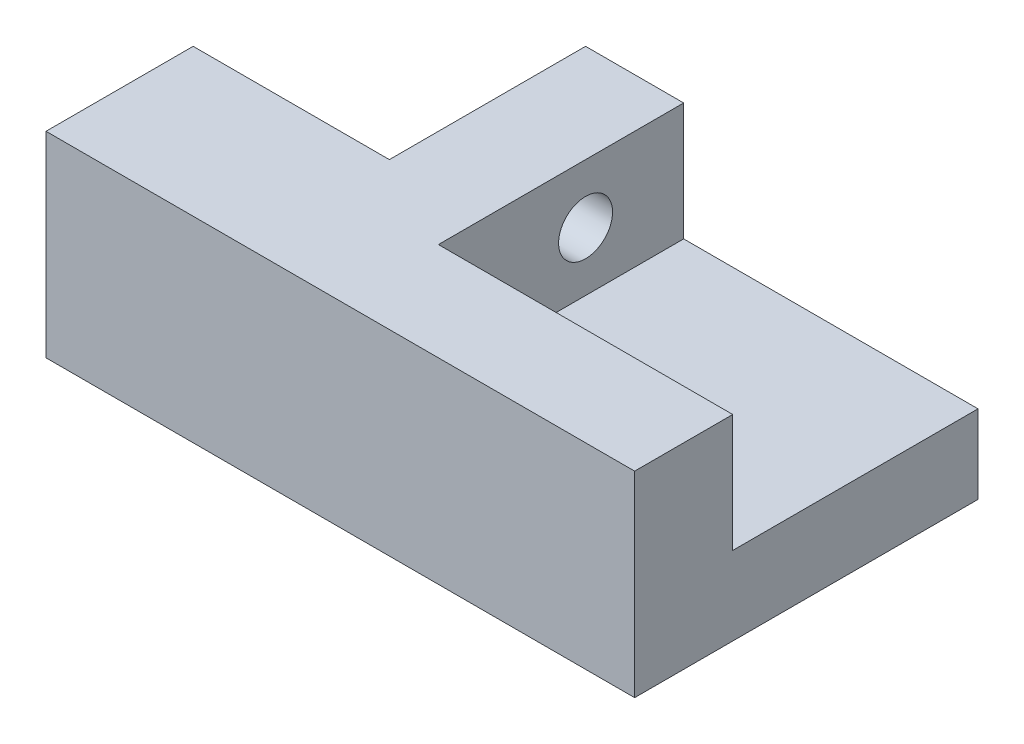
ISO-10303-21;
HEADER;
FILE_DESCRIPTION(('STEP AP214'),'2;1');
FILE_NAME('part.step','',(''),(''),'','','');
FILE_SCHEMA(('AUTOMOTIVE_DESIGN { 1 0 10303 214 1 1 1 1 }'));
ENDSEC;
DATA;
#1=APPLICATION_CONTEXT('core data for automotive mechanical design processes');
#2=APPLICATION_PROTOCOL_DEFINITION('international standard','automotive_design',2000,#1);
#3=PRODUCT_CONTEXT('',#1,'mechanical');
#4=PRODUCT('Part','Part','',(#3));
#5=PRODUCT_RELATED_PRODUCT_CATEGORY('part','',(#4));
#6=PRODUCT_DEFINITION_FORMATION('','',#4);
#7=PRODUCT_DEFINITION_CONTEXT('part definition',#1,'design');
#8=PRODUCT_DEFINITION('design','',#6,#7);
#9=PRODUCT_DEFINITION_SHAPE('','',#8);
#10=(LENGTH_UNIT() NAMED_UNIT(*) SI_UNIT(.MILLI.,.METRE.));
#11=(NAMED_UNIT(*) PLANE_ANGLE_UNIT() SI_UNIT($,.RADIAN.));
#12=(NAMED_UNIT(*) SI_UNIT($,.STERADIAN.) SOLID_ANGLE_UNIT());
#13=UNCERTAINTY_MEASURE_WITH_UNIT(LENGTH_MEASURE(1.E-05),#10,'distance_accuracy_value','');
#14=(GEOMETRIC_REPRESENTATION_CONTEXT(3) GLOBAL_UNCERTAINTY_ASSIGNED_CONTEXT((#13)) GLOBAL_UNIT_ASSIGNED_CONTEXT((#10,
#11,#12)) REPRESENTATION_CONTEXT('',''));
#15=CARTESIAN_POINT('',(0.,0.,0.));
#16=DIRECTION('',(0.,0.,1.));
#17=DIRECTION('',(1.,0.,0.));
#18=AXIS2_PLACEMENT_3D('',#15,#16,#17);
#19=CARTESIAN_POINT('',(0.,20.,0.));
#20=DIRECTION('',(1.,0.,0.));
#21=DIRECTION('',(0.,0.,-1.));
#22=AXIS2_PLACEMENT_3D('',#19,#20,#21);
#23=PLANE('',#22);
#24=DIRECTION('',(0.,0.,1.));
#25=VECTOR('',#24,1.);
#26=CARTESIAN_POINT('',(0.,0.,0.));
#27=LINE('',#26,#25);
#28=CARTESIAN_POINT('',(0.,0.,-15.));
#29=VERTEX_POINT('',#28);
#30=CARTESIAN_POINT('',(0.,0.,0.));
#31=VERTEX_POINT('',#30);
#32=EDGE_CURVE('E126',#29,#31,#27,.T.);
#33=ORIENTED_EDGE('',*,*,#32,.T.);
#34=DIRECTION('',(0.,-1.,0.));
#35=VECTOR('',#34,1.);
#36=CARTESIAN_POINT('',(0.,20.,0.));
#37=LINE('',#36,#35);
#38=CARTESIAN_POINT('',(0.,20.,0.));
#39=VERTEX_POINT('',#38);
#40=EDGE_CURVE('E11',#39,#31,#37,.T.);
#41=ORIENTED_EDGE('',*,*,#40,.F.);
#42=DIRECTION('',(0.,0.,1.));
#43=VECTOR('',#42,1.);
#44=CARTESIAN_POINT('',(0.,20.,0.));
#45=LINE('',#44,#43);
#46=CARTESIAN_POINT('',(0.,20.,-15.));
#47=VERTEX_POINT('',#46);
#48=EDGE_CURVE('E139',#47,#39,#45,.T.);
#49=ORIENTED_EDGE('',*,*,#48,.F.);
#50=DIRECTION('',(0.,-1.,0.));
#51=VECTOR('',#50,1.);
#52=CARTESIAN_POINT('',(0.,20.,-15.));
#53=LINE('',#52,#51);
#54=EDGE_CURVE('E122',#47,#29,#53,.T.);
#55=ORIENTED_EDGE('',*,*,#54,.T.);
#56=EDGE_LOOP('',(#33,#41,#49,#55));
#57=FACE_BOUND('',#56,.T.);
#58=ADVANCED_FACE('F33',(#57),#23,.F.);
#59=CARTESIAN_POINT('',(0.,20.,0.));
#60=DIRECTION('',(0.,0.,-1.));
#61=DIRECTION('',(-1.,0.,0.));
#62=AXIS2_PLACEMENT_3D('',#59,#60,#61);
#63=PLANE('',#62);
#64=DIRECTION('',(1.,0.,0.));
#65=VECTOR('',#64,1.);
#66=CARTESIAN_POINT('',(0.,0.,0.));
#67=LINE('',#66,#65);
#68=CARTESIAN_POINT('',(60.,0.,0.));
#69=VERTEX_POINT('',#68);
#70=EDGE_CURVE('E129',#31,#69,#67,.T.);
#71=ORIENTED_EDGE('',*,*,#70,.T.);
#72=DIRECTION('',(0.,-1.,0.));
#73=VECTOR('',#72,1.);
#74=CARTESIAN_POINT('',(60.,20.,0.));
#75=LINE('',#74,#73);
#76=CARTESIAN_POINT('',(60.,20.,0.));
#77=VERTEX_POINT('',#76);
#78=EDGE_CURVE('E40',#77,#69,#75,.T.);
#79=ORIENTED_EDGE('',*,*,#78,.F.);
#80=DIRECTION('',(1.,0.,0.));
#81=VECTOR('',#80,1.);
#82=CARTESIAN_POINT('',(0.,20.,0.));
#83=LINE('',#82,#81);
#84=EDGE_CURVE('E91',#39,#77,#83,.T.);
#85=ORIENTED_EDGE('',*,*,#84,.F.);
#86=ORIENTED_EDGE('',*,*,#40,.T.);
#87=EDGE_LOOP('',(#71,#79,#85,#86));
#88=FACE_BOUND('',#87,.T.);
#89=ADVANCED_FACE('F209',(#88),#63,.F.);
#90=CARTESIAN_POINT('',(60.,20.,0.));
#91=DIRECTION('',(-1.,0.,0.));
#92=DIRECTION('',(0.,0.,1.));
#93=AXIS2_PLACEMENT_3D('',#90,#91,#92);
#94=PLANE('',#93);
#95=DIRECTION('',(0.,0.,-1.));
#96=VECTOR('',#95,1.);
#97=CARTESIAN_POINT('',(60.,8.,-35.));
#98=LINE('',#97,#96);
#99=CARTESIAN_POINT('',(60.,8.,-10.));
#100=VERTEX_POINT('',#99);
#101=CARTESIAN_POINT('',(60.,8.,-35.));
#102=VERTEX_POINT('',#101);
#103=EDGE_CURVE('E189',#100,#102,#98,.T.);
#104=ORIENTED_EDGE('',*,*,#103,.F.);
#105=DIRECTION('',(0.,1.,0.));
#106=VECTOR('',#105,1.);
#107=CARTESIAN_POINT('',(60.,8.,-10.));
#108=LINE('',#107,#106);
#109=CARTESIAN_POINT('',(60.,20.,-10.));
#110=VERTEX_POINT('',#109);
#111=EDGE_CURVE('E130',#100,#110,#108,.T.);
#112=ORIENTED_EDGE('',*,*,#111,.T.);
#113=DIRECTION('',(0.,0.,-1.));
#114=VECTOR('',#113,1.);
#115=CARTESIAN_POINT('',(60.,20.,0.));
#116=LINE('',#115,#114);
#117=EDGE_CURVE('E108',#77,#110,#116,.T.);
#118=ORIENTED_EDGE('',*,*,#117,.F.);
#119=ORIENTED_EDGE('',*,*,#78,.T.);
#120=DIRECTION('',(0.,0.,-1.));
#121=VECTOR('',#120,1.);
#122=CARTESIAN_POINT('',(60.,0.,0.));
#123=LINE('',#122,#121);
#124=CARTESIAN_POINT('',(60.,0.,-35.));
#125=VERTEX_POINT('',#124);
#126=EDGE_CURVE('E132',#69,#125,#123,.T.);
#127=ORIENTED_EDGE('',*,*,#126,.T.);
#128=DIRECTION('',(0.,-1.,0.));
#129=VECTOR('',#128,1.);
#130=CARTESIAN_POINT('',(60.,20.,-35.));
#131=LINE('',#130,#129);
#132=EDGE_CURVE('E117',#102,#125,#131,.T.);
#133=ORIENTED_EDGE('',*,*,#132,.F.);
#134=EDGE_LOOP('',(#104,#112,#118,#119,#127,#133));
#135=FACE_BOUND('',#134,.T.);
#136=ADVANCED_FACE('F147',(#135),#94,.F.);
#137=CARTESIAN_POINT('',(20.,20.,-35.));
#138=DIRECTION('',(0.,0.,1.));
#139=DIRECTION('',(1.,0.,0.));
#140=AXIS2_PLACEMENT_3D('',#137,#138,#139);
#141=PLANE('',#140);
#142=DIRECTION('',(-1.,0.,0.));
#143=VECTOR('',#142,1.);
#144=CARTESIAN_POINT('',(20.,20.,-35.));
#145=LINE('',#144,#143);
#146=CARTESIAN_POINT('',(30.,20.,-35.));
#147=VERTEX_POINT('',#146);
#148=CARTESIAN_POINT('',(20.,20.,-35.));
#149=VERTEX_POINT('',#148);
#150=EDGE_CURVE('E98',#147,#149,#145,.T.);
#151=ORIENTED_EDGE('',*,*,#150,.F.);
#152=DIRECTION('',(0.,1.,0.));
#153=VECTOR('',#152,1.);
#154=CARTESIAN_POINT('',(30.,8.,-35.));
#155=LINE('',#154,#153);
#156=CARTESIAN_POINT('',(30.,8.,-35.));
#157=VERTEX_POINT('',#156);
#158=EDGE_CURVE('E47',#157,#147,#155,.T.);
#159=ORIENTED_EDGE('',*,*,#158,.F.);
#160=DIRECTION('',(-1.,0.,0.));
#161=VECTOR('',#160,1.);
#162=CARTESIAN_POINT('',(60.,8.,-35.));
#163=LINE('',#162,#161);
#164=EDGE_CURVE('E185',#102,#157,#163,.T.);
#165=ORIENTED_EDGE('',*,*,#164,.F.);
#166=ORIENTED_EDGE('',*,*,#132,.T.);
#167=DIRECTION('',(-1.,0.,0.));
#168=VECTOR('',#167,1.);
#169=CARTESIAN_POINT('',(20.,0.,-35.));
#170=LINE('',#169,#168);
#171=CARTESIAN_POINT('',(20.,0.,-35.));
#172=VERTEX_POINT('',#171);
#173=EDGE_CURVE('E114',#125,#172,#170,.T.);
#174=ORIENTED_EDGE('',*,*,#173,.T.);
#175=DIRECTION('',(0.,-1.,0.));
#176=VECTOR('',#175,1.);
#177=CARTESIAN_POINT('',(20.,20.,-35.));
#178=LINE('',#177,#176);
#179=EDGE_CURVE('E111',#149,#172,#178,.T.);
#180=ORIENTED_EDGE('',*,*,#179,.F.);
#181=EDGE_LOOP('',(#151,#159,#165,#166,#174,#180));
#182=FACE_BOUND('',#181,.T.);
#183=ADVANCED_FACE('F112',(#182),#141,.F.);
#184=CARTESIAN_POINT('',(20.,20.,-35.));
#185=DIRECTION('',(1.,0.,0.));
#186=DIRECTION('',(0.,0.,-1.));
#187=AXIS2_PLACEMENT_3D('',#184,#185,#186);
#188=PLANE('',#187);
#189=CARTESIAN_POINT('',(20.,14.,-25.));
#190=DIRECTION('',(1.,0.,0.));
#191=DIRECTION('',(0.,0.,-1.));
#192=AXIS2_PLACEMENT_3D('',#189,#190,#191);
#193=CIRCLE('',#192,2.75);
#194=CARTESIAN_POINT('',(20.,14.,-27.75));
#195=VERTEX_POINT('',#194);
#196=EDGE_CURVE('E194',#195,#195,#193,.T.);
#197=ORIENTED_EDGE('',*,*,#196,.T.);
#198=EDGE_LOOP('',(#197));
#199=FACE_BOUND('',#198,.T.);
#200=DIRECTION('',(0.,0.,1.));
#201=VECTOR('',#200,1.);
#202=CARTESIAN_POINT('',(20.,0.,-35.));
#203=LINE('',#202,#201);
#204=CARTESIAN_POINT('',(20.,0.,-15.));
#205=VERTEX_POINT('',#204);
#206=EDGE_CURVE('E136',#172,#205,#203,.T.);
#207=ORIENTED_EDGE('',*,*,#206,.T.);
#208=DIRECTION('',(0.,-1.,0.));
#209=VECTOR('',#208,1.);
#210=CARTESIAN_POINT('',(20.,20.,-15.));
#211=LINE('',#210,#209);
#212=CARTESIAN_POINT('',(20.,20.,-15.));
#213=VERTEX_POINT('',#212);
#214=EDGE_CURVE('E118',#213,#205,#211,.T.);
#215=ORIENTED_EDGE('',*,*,#214,.F.);
#216=DIRECTION('',(0.,0.,1.));
#217=VECTOR('',#216,1.);
#218=CARTESIAN_POINT('',(20.,20.,-35.));
#219=LINE('',#218,#217);
#220=EDGE_CURVE('E103',#149,#213,#219,.T.);
#221=ORIENTED_EDGE('',*,*,#220,.F.);
#222=ORIENTED_EDGE('',*,*,#179,.T.);
#223=EDGE_LOOP('',(#207,#215,#221,#222));
#224=FACE_BOUND('',#223,.T.);
#225=ADVANCED_FACE('F120',(#199,#224),#188,.F.);
#226=CARTESIAN_POINT('',(0.,20.,-15.));
#227=DIRECTION('',(0.,0.,1.));
#228=DIRECTION('',(1.,0.,0.));
#229=AXIS2_PLACEMENT_3D('',#226,#227,#228);
#230=PLANE('',#229);
#231=DIRECTION('',(-1.,0.,0.));
#232=VECTOR('',#231,1.);
#233=CARTESIAN_POINT('',(0.,0.,-15.));
#234=LINE('',#233,#232);
#235=EDGE_CURVE('E83',#205,#29,#234,.T.);
#236=ORIENTED_EDGE('',*,*,#235,.T.);
#237=ORIENTED_EDGE('',*,*,#54,.F.);
#238=DIRECTION('',(-1.,0.,0.));
#239=VECTOR('',#238,1.);
#240=CARTESIAN_POINT('',(0.,20.,-15.));
#241=LINE('',#240,#239);
#242=EDGE_CURVE('E56',#213,#47,#241,.T.);
#243=ORIENTED_EDGE('',*,*,#242,.F.);
#244=ORIENTED_EDGE('',*,*,#214,.T.);
#245=EDGE_LOOP('',(#236,#237,#243,#244));
#246=FACE_BOUND('',#245,.T.);
#247=ADVANCED_FACE('F153',(#246),#230,.F.);
#248=CARTESIAN_POINT('',(0.,20.,0.));
#249=DIRECTION('',(0.,-1.,0.));
#250=DIRECTION('',(0.,0.,-1.));
#251=AXIS2_PLACEMENT_3D('',#248,#249,#250);
#252=PLANE('',#251);
#253=ORIENTED_EDGE('',*,*,#117,.T.);
#254=DIRECTION('',(1.,0.,0.));
#255=VECTOR('',#254,1.);
#256=CARTESIAN_POINT('',(60.,20.,-10.));
#257=LINE('',#256,#255);
#258=CARTESIAN_POINT('',(30.,20.,-10.));
#259=VERTEX_POINT('',#258);
#260=EDGE_CURVE('E163',#259,#110,#257,.T.);
#261=ORIENTED_EDGE('',*,*,#260,.F.);
#262=DIRECTION('',(0.,0.,1.));
#263=VECTOR('',#262,1.);
#264=CARTESIAN_POINT('',(30.,20.,-35.));
#265=LINE('',#264,#263);
#266=EDGE_CURVE('E106',#147,#259,#265,.T.);
#267=ORIENTED_EDGE('',*,*,#266,.F.);
#268=ORIENTED_EDGE('',*,*,#150,.T.);
#269=ORIENTED_EDGE('',*,*,#220,.T.);
#270=ORIENTED_EDGE('',*,*,#242,.T.);
#271=ORIENTED_EDGE('',*,*,#48,.T.);
#272=ORIENTED_EDGE('',*,*,#84,.T.);
#273=EDGE_LOOP('',(#253,#261,#267,#268,#269,#270,#271,#272));
#274=FACE_BOUND('',#273,.T.);
#275=ADVANCED_FACE('F101',(#274),#252,.F.);
#276=CARTESIAN_POINT('',(0.,0.,0.));
#277=DIRECTION('',(0.,-1.,0.));
#278=DIRECTION('',(0.,0.,-1.));
#279=AXIS2_PLACEMENT_3D('',#276,#277,#278);
#280=PLANE('',#279);
#281=CARTESIAN_POINT('',(46.1,0.,-12.5257624928588));
#282=DIRECTION('',(0.,-1.,0.));
#283=DIRECTION('',(0.,0.,-1.));
#284=AXIS2_PLACEMENT_3D('',#281,#282,#283);
#285=CIRCLE('',#284,6.7);
#286=CARTESIAN_POINT('',(46.1,0.,-19.2257624928588));
#287=VERTEX_POINT('',#286);
#288=EDGE_CURVE('E301',#287,#287,#285,.T.);
#289=ORIENTED_EDGE('',*,*,#288,.F.);
#290=EDGE_LOOP('',(#289));
#291=FACE_BOUND('',#290,.T.);
#292=ORIENTED_EDGE('',*,*,#32,.F.);
#293=ORIENTED_EDGE('',*,*,#235,.F.);
#294=ORIENTED_EDGE('',*,*,#206,.F.);
#295=ORIENTED_EDGE('',*,*,#173,.F.);
#296=ORIENTED_EDGE('',*,*,#126,.F.);
#297=ORIENTED_EDGE('',*,*,#70,.F.);
#298=EDGE_LOOP('',(#292,#293,#294,#295,#296,#297));
#299=FACE_BOUND('',#298,.T.);
#300=ADVANCED_FACE('F152',(#291,#299),#280,.T.);
#301=CARTESIAN_POINT('',(60.,8.,-10.));
#302=DIRECTION('',(0.,0.,1.));
#303=DIRECTION('',(1.,0.,0.));
#304=AXIS2_PLACEMENT_3D('',#301,#302,#303);
#305=PLANE('',#304);
#306=ORIENTED_EDGE('',*,*,#260,.T.);
#307=ORIENTED_EDGE('',*,*,#111,.F.);
#308=DIRECTION('',(1.,0.,0.));
#309=VECTOR('',#308,1.);
#310=CARTESIAN_POINT('',(60.,8.,-10.));
#311=LINE('',#310,#309);
#312=CARTESIAN_POINT('',(30.,8.,-10.));
#313=VERTEX_POINT('',#312);
#314=EDGE_CURVE('E184',#313,#100,#311,.T.);
#315=ORIENTED_EDGE('',*,*,#314,.F.);
#316=DIRECTION('',(0.,1.,0.));
#317=VECTOR('',#316,1.);
#318=CARTESIAN_POINT('',(30.,8.,-10.));
#319=LINE('',#318,#317);
#320=EDGE_CURVE('E173',#313,#259,#319,.T.);
#321=ORIENTED_EDGE('',*,*,#320,.T.);
#322=EDGE_LOOP('',(#306,#307,#315,#321));
#323=FACE_BOUND('',#322,.T.);
#324=ADVANCED_FACE('F196',(#323),#305,.F.);
#325=CARTESIAN_POINT('',(30.,8.,-35.));
#326=DIRECTION('',(-1.,0.,0.));
#327=DIRECTION('',(0.,0.,1.));
#328=AXIS2_PLACEMENT_3D('',#325,#326,#327);
#329=PLANE('',#328);
#330=CARTESIAN_POINT('',(30.,14.,-25.));
#331=DIRECTION('',(1.,0.,0.));
#332=DIRECTION('',(0.,0.,-1.));
#333=AXIS2_PLACEMENT_3D('',#330,#331,#332);
#334=CIRCLE('',#333,2.75);
#335=CARTESIAN_POINT('',(30.,14.,-27.75));
#336=VERTEX_POINT('',#335);
#337=EDGE_CURVE('E293',#336,#336,#334,.T.);
#338=ORIENTED_EDGE('',*,*,#337,.F.);
#339=EDGE_LOOP('',(#338));
#340=FACE_BOUND('',#339,.T.);
#341=ORIENTED_EDGE('',*,*,#266,.T.);
#342=ORIENTED_EDGE('',*,*,#320,.F.);
#343=DIRECTION('',(0.,0.,1.));
#344=VECTOR('',#343,1.);
#345=CARTESIAN_POINT('',(30.,8.,-35.));
#346=LINE('',#345,#344);
#347=EDGE_CURVE('E179',#157,#313,#346,.T.);
#348=ORIENTED_EDGE('',*,*,#347,.F.);
#349=ORIENTED_EDGE('',*,*,#158,.T.);
#350=EDGE_LOOP('',(#341,#342,#348,#349));
#351=FACE_BOUND('',#350,.T.);
#352=ADVANCED_FACE('F181',(#340,#351),#329,.F.);
#353=CARTESIAN_POINT('',(0.,8.,0.));
#354=DIRECTION('',(0.,-1.,0.));
#355=DIRECTION('',(0.,0.,-1.));
#356=AXIS2_PLACEMENT_3D('',#353,#354,#355);
#357=PLANE('',#356);
#358=CARTESIAN_POINT('',(46.1,8.,-12.5257624928588));
#359=DIRECTION('',(0.,-1.,0.));
#360=DIRECTION('',(0.,0.,-1.));
#361=AXIS2_PLACEMENT_3D('',#358,#359,#360);
#362=CIRCLE('',#361,2.49999999999999);
#363=CARTESIAN_POINT('',(46.1,8.,-15.0257624928588));
#364=VERTEX_POINT('',#363);
#365=EDGE_CURVE('E304',#364,#364,#362,.T.);
#366=ORIENTED_EDGE('',*,*,#365,.T.);
#367=EDGE_LOOP('',(#366));
#368=FACE_BOUND('',#367,.T.);
#369=ORIENTED_EDGE('',*,*,#103,.T.);
#370=ORIENTED_EDGE('',*,*,#164,.T.);
#371=ORIENTED_EDGE('',*,*,#347,.T.);
#372=ORIENTED_EDGE('',*,*,#314,.T.);
#373=EDGE_LOOP('',(#369,#370,#371,#372));
#374=FACE_BOUND('',#373,.T.);
#375=ADVANCED_FACE('F188',(#368,#374),#357,.F.);
#376=CARTESIAN_POINT('',(0.,14.,-25.));
#377=DIRECTION('',(1.,0.,0.));
#378=DIRECTION('',(0.,0.,-1.));
#379=AXIS2_PLACEMENT_3D('',#376,#377,#378);
#380=CYLINDRICAL_SURFACE('',#379,2.75);
#381=ORIENTED_EDGE('',*,*,#337,.T.);
#382=EDGE_LOOP('',(#381));
#383=FACE_BOUND('',#382,.T.);
#384=ORIENTED_EDGE('',*,*,#196,.F.);
#385=EDGE_LOOP('',(#384));
#386=FACE_BOUND('',#385,.T.);
#387=ADVANCED_FACE('F242',(#383,#386),#380,.F.);
#388=CARTESIAN_POINT('',(46.1,5.,-12.5257624928588));
#389=DIRECTION('',(0.,-1.,0.));
#390=DIRECTION('',(0.,0.,-1.));
#391=AXIS2_PLACEMENT_3D('',#388,#389,#390);
#392=CYLINDRICAL_SURFACE('',#391,6.7);
#393=CARTESIAN_POINT('',(46.1,5.,-12.5257624928588));
#394=DIRECTION('',(0.,-1.,0.));
#395=DIRECTION('',(0.,0.,-1.));
#396=AXIS2_PLACEMENT_3D('',#393,#394,#395);
#397=CIRCLE('',#396,6.7);
#398=CARTESIAN_POINT('',(46.1,5.,-19.2257624928588));
#399=VERTEX_POINT('',#398);
#400=EDGE_CURVE('E297',#399,#399,#397,.T.);
#401=ORIENTED_EDGE('',*,*,#400,.F.);
#402=EDGE_LOOP('',(#401));
#403=FACE_BOUND('',#402,.T.);
#404=ORIENTED_EDGE('',*,*,#288,.T.);
#405=EDGE_LOOP('',(#404));
#406=FACE_BOUND('',#405,.T.);
#407=ADVANCED_FACE('F247',(#403,#406),#392,.F.);
#408=CARTESIAN_POINT('',(46.1,5.,-12.5257624928588));
#409=DIRECTION('',(0.,-1.,0.));
#410=DIRECTION('',(0.,0.,-1.));
#411=AXIS2_PLACEMENT_3D('',#408,#409,#410);
#412=PLANE('',#411);
#413=CARTESIAN_POINT('',(46.1,5.,-12.5257624928588));
#414=DIRECTION('',(0.,-1.,0.));
#415=DIRECTION('',(0.,0.,-1.));
#416=AXIS2_PLACEMENT_3D('',#413,#414,#415);
#417=CIRCLE('',#416,2.49999999999999);
#418=CARTESIAN_POINT('',(46.1,5.,-15.0257624928588));
#419=VERTEX_POINT('',#418);
#420=EDGE_CURVE('E309',#419,#419,#417,.T.);
#421=ORIENTED_EDGE('',*,*,#420,.F.);
#422=EDGE_LOOP('',(#421));
#423=FACE_BOUND('',#422,.T.);
#424=ORIENTED_EDGE('',*,*,#400,.T.);
#425=EDGE_LOOP('',(#424));
#426=FACE_BOUND('',#425,.T.);
#427=ADVANCED_FACE('F252',(#423,#426),#412,.T.);
#428=CARTESIAN_POINT('',(46.1,20.,-12.5257624928588));
#429=DIRECTION('',(0.,-1.,0.));
#430=DIRECTION('',(0.,0.,-1.));
#431=AXIS2_PLACEMENT_3D('',#428,#429,#430);
#432=CYLINDRICAL_SURFACE('',#431,2.49999999999999);
#433=ORIENTED_EDGE('',*,*,#420,.T.);
#434=EDGE_LOOP('',(#433));
#435=FACE_BOUND('',#434,.T.);
#436=ORIENTED_EDGE('',*,*,#365,.F.);
#437=EDGE_LOOP('',(#436));
#438=FACE_BOUND('',#437,.T.);
#439=ADVANCED_FACE('F271',(#435,#438),#432,.F.);
#440=CLOSED_SHELL('',(#58,#89,#136,#183,#225,#247,#275,#300,#324,#352,#375,#387,#407,#427,#439));
#441=MANIFOLD_SOLID_BREP('B2',#440);
#442=ADVANCED_BREP_SHAPE_REPRESENTATION('',(#18,#441),#14);
#443=SHAPE_DEFINITION_REPRESENTATION(#9,#442);
ENDSEC;
END-ISO-10303-21;
